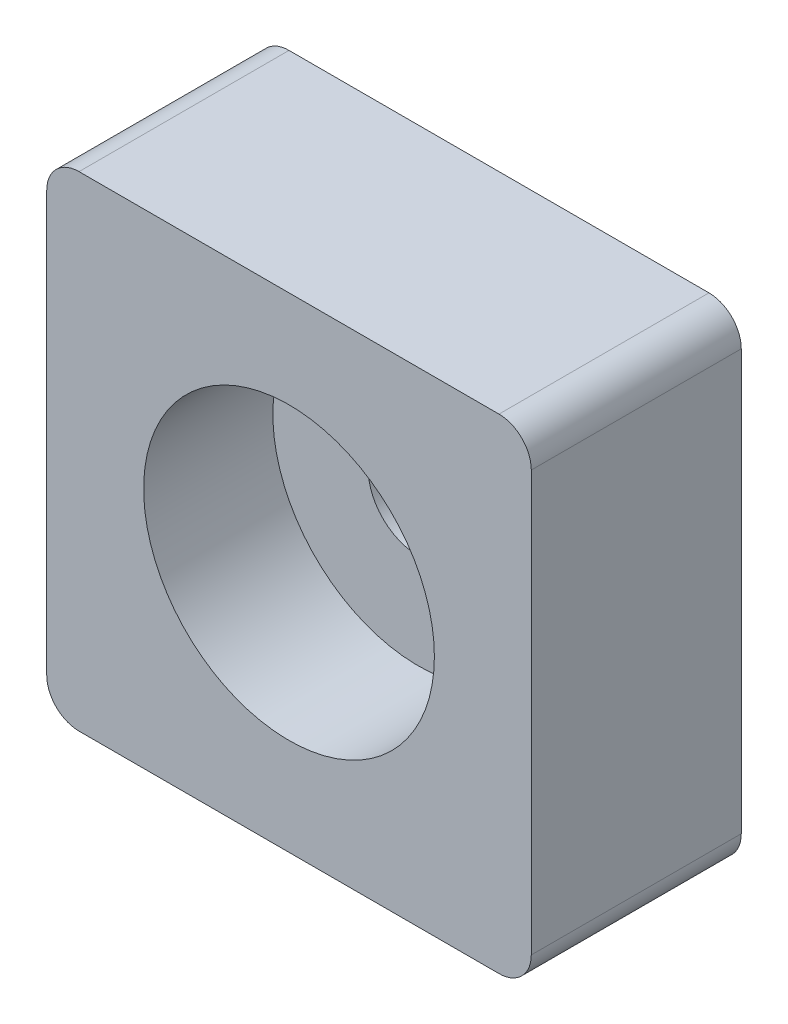
ISO-10303-21;
HEADER;
FILE_DESCRIPTION(('STEP AP214'),'2;1');
FILE_NAME('part.step','',(''),(''),'','','');
FILE_SCHEMA(('AUTOMOTIVE_DESIGN { 1 0 10303 214 1 1 1 1 }'));
ENDSEC;
DATA;
#1=APPLICATION_CONTEXT('core data for automotive mechanical design processes');
#2=APPLICATION_PROTOCOL_DEFINITION('international standard','automotive_design',2000,#1);
#3=PRODUCT_CONTEXT('',#1,'mechanical');
#4=PRODUCT('Part','Part','',(#3));
#5=PRODUCT_RELATED_PRODUCT_CATEGORY('part','',(#4));
#6=PRODUCT_DEFINITION_FORMATION('','',#4);
#7=PRODUCT_DEFINITION_CONTEXT('part definition',#1,'design');
#8=PRODUCT_DEFINITION('design','',#6,#7);
#9=PRODUCT_DEFINITION_SHAPE('','',#8);
#10=(LENGTH_UNIT() NAMED_UNIT(*) SI_UNIT(.MILLI.,.METRE.));
#11=(NAMED_UNIT(*) PLANE_ANGLE_UNIT() SI_UNIT($,.RADIAN.));
#12=(NAMED_UNIT(*) SI_UNIT($,.STERADIAN.) SOLID_ANGLE_UNIT());
#13=UNCERTAINTY_MEASURE_WITH_UNIT(LENGTH_MEASURE(1.E-05),#10,'distance_accuracy_value','');
#14=(GEOMETRIC_REPRESENTATION_CONTEXT(3) GLOBAL_UNCERTAINTY_ASSIGNED_CONTEXT((#13)) GLOBAL_UNIT_ASSIGNED_CONTEXT((#10,
#11,#12)) REPRESENTATION_CONTEXT('',''));
#15=CARTESIAN_POINT('',(0.,0.,0.));
#16=DIRECTION('',(0.,0.,1.));
#17=DIRECTION('',(1.,0.,0.));
#18=AXIS2_PLACEMENT_3D('',#15,#16,#17);
#19=CARTESIAN_POINT('',(0.,0.,13.));
#20=DIRECTION('',(0.,0.,-1.));
#21=DIRECTION('',(-1.,0.,0.));
#22=AXIS2_PLACEMENT_3D('',#19,#20,#21);
#23=CYLINDRICAL_SURFACE('',#22,3.1);
#24=CARTESIAN_POINT('',(0.,0.,0.));
#25=DIRECTION('',(0.,0.,1.));
#26=DIRECTION('',(1.,0.,0.));
#27=AXIS2_PLACEMENT_3D('',#24,#25,#26);
#28=CIRCLE('',#27,3.1);
#29=CARTESIAN_POINT('',(3.1,0.,0.));
#30=VERTEX_POINT('',#29);
#31=EDGE_CURVE('E140',#30,#30,#28,.T.);
#32=ORIENTED_EDGE('',*,*,#31,.F.);
#33=EDGE_LOOP('',(#32));
#34=FACE_BOUND('',#33,.T.);
#35=CARTESIAN_POINT('',(0.,0.,5.));
#36=DIRECTION('',(0.,0.,1.));
#37=DIRECTION('',(1.,0.,0.));
#38=AXIS2_PLACEMENT_3D('',#35,#36,#37);
#39=CIRCLE('',#38,3.1);
#40=CARTESIAN_POINT('',(3.1,0.,5.));
#41=VERTEX_POINT('',#40);
#42=EDGE_CURVE('E137',#41,#41,#39,.T.);
#43=ORIENTED_EDGE('',*,*,#42,.T.);
#44=EDGE_LOOP('',(#43));
#45=FACE_BOUND('',#44,.T.);
#46=ADVANCED_FACE('F37',(#34,#45),#23,.F.);
#47=CARTESIAN_POINT('',(0.,0.,13.));
#48=DIRECTION('',(0.,0.,-1.));
#49=DIRECTION('',(-1.,0.,0.));
#50=AXIS2_PLACEMENT_3D('',#47,#48,#49);
#51=PLANE('',#50);
#52=CARTESIAN_POINT('',(0.,0.,13.));
#53=DIRECTION('',(0.,0.,1.));
#54=DIRECTION('',(1.,0.,0.));
#55=AXIS2_PLACEMENT_3D('',#52,#53,#54);
#56=CIRCLE('',#55,9.);
#57=CARTESIAN_POINT('',(9.,0.,13.));
#58=VERTEX_POINT('',#57);
#59=EDGE_CURVE('E203',#58,#58,#56,.T.);
#60=ORIENTED_EDGE('',*,*,#59,.F.);
#61=EDGE_LOOP('',(#60));
#62=FACE_BOUND('',#61,.T.);
#63=DIRECTION('',(-1.,0.,0.));
#64=VECTOR('',#63,1.);
#65=CARTESIAN_POINT('',(-15.,15.,13.));
#66=LINE('',#65,#64);
#67=CARTESIAN_POINT('',(13.,15.,13.));
#68=VERTEX_POINT('',#67);
#69=CARTESIAN_POINT('',(-13.,15.,13.));
#70=VERTEX_POINT('',#69);
#71=EDGE_CURVE('E178',#68,#70,#66,.T.);
#72=ORIENTED_EDGE('',*,*,#71,.T.);
#73=CARTESIAN_POINT('',(-13.,13.,13.));
#74=DIRECTION('',(0.,0.,-1.));
#75=DIRECTION('',(-1.,0.,0.));
#76=AXIS2_PLACEMENT_3D('',#73,#74,#75);
#77=CIRCLE('',#76,2.);
#78=CARTESIAN_POINT('',(-15.,13.,13.));
#79=VERTEX_POINT('',#78);
#80=EDGE_CURVE('E156',#70,#79,#77,.F.);
#81=ORIENTED_EDGE('',*,*,#80,.T.);
#82=DIRECTION('',(0.,-1.,0.));
#83=VECTOR('',#82,1.);
#84=CARTESIAN_POINT('',(-15.,-15.,13.));
#85=LINE('',#84,#83);
#86=CARTESIAN_POINT('',(-15.,-13.,13.));
#87=VERTEX_POINT('',#86);
#88=EDGE_CURVE('E121',#79,#87,#85,.T.);
#89=ORIENTED_EDGE('',*,*,#88,.T.);
#90=CARTESIAN_POINT('',(-13.,-13.,13.));
#91=DIRECTION('',(0.,0.,-1.));
#92=DIRECTION('',(-1.,0.,0.));
#93=AXIS2_PLACEMENT_3D('',#90,#91,#92);
#94=CIRCLE('',#93,2.);
#95=CARTESIAN_POINT('',(-13.,-15.,13.));
#96=VERTEX_POINT('',#95);
#97=EDGE_CURVE('E57',#87,#96,#94,.F.);
#98=ORIENTED_EDGE('',*,*,#97,.T.);
#99=DIRECTION('',(1.,0.,0.));
#100=VECTOR('',#99,1.);
#101=CARTESIAN_POINT('',(-15.,-15.,13.));
#102=LINE('',#101,#100);
#103=CARTESIAN_POINT('',(13.,-15.,13.));
#104=VERTEX_POINT('',#103);
#105=EDGE_CURVE('E142',#96,#104,#102,.T.);
#106=ORIENTED_EDGE('',*,*,#105,.T.);
#107=CARTESIAN_POINT('',(13.,-13.,13.));
#108=DIRECTION('',(0.,0.,-1.));
#109=DIRECTION('',(-1.,0.,0.));
#110=AXIS2_PLACEMENT_3D('',#107,#108,#109);
#111=CIRCLE('',#110,2.);
#112=CARTESIAN_POINT('',(15.,-13.,13.));
#113=VERTEX_POINT('',#112);
#114=EDGE_CURVE('E152',#104,#113,#111,.F.);
#115=ORIENTED_EDGE('',*,*,#114,.T.);
#116=DIRECTION('',(0.,1.,0.));
#117=VECTOR('',#116,1.);
#118=CARTESIAN_POINT('',(15.,-15.,13.));
#119=LINE('',#118,#117);
#120=CARTESIAN_POINT('',(15.,13.,13.));
#121=VERTEX_POINT('',#120);
#122=EDGE_CURVE('E131',#113,#121,#119,.T.);
#123=ORIENTED_EDGE('',*,*,#122,.T.);
#124=CARTESIAN_POINT('',(13.,13.,13.));
#125=DIRECTION('',(0.,0.,-1.));
#126=DIRECTION('',(-1.,0.,0.));
#127=AXIS2_PLACEMENT_3D('',#124,#125,#126);
#128=CIRCLE('',#127,2.);
#129=EDGE_CURVE('E154',#121,#68,#128,.F.);
#130=ORIENTED_EDGE('',*,*,#129,.T.);
#131=EDGE_LOOP('',(#72,#81,#89,#98,#106,#115,#123,#130));
#132=FACE_BOUND('',#131,.T.);
#133=ADVANCED_FACE('F191',(#62,#132),#51,.F.);
#134=CARTESIAN_POINT('',(0.,0.,0.));
#135=DIRECTION('',(0.,0.,-1.));
#136=DIRECTION('',(-1.,0.,0.));
#137=AXIS2_PLACEMENT_3D('',#134,#135,#136);
#138=PLANE('',#137);
#139=DIRECTION('',(0.,-1.,0.));
#140=VECTOR('',#139,1.);
#141=CARTESIAN_POINT('',(-15.,-15.,0.));
#142=LINE('',#141,#140);
#143=CARTESIAN_POINT('',(-15.,13.,0.));
#144=VERTEX_POINT('',#143);
#145=CARTESIAN_POINT('',(-15.,-13.,0.));
#146=VERTEX_POINT('',#145);
#147=EDGE_CURVE('E119',#144,#146,#142,.T.);
#148=ORIENTED_EDGE('',*,*,#147,.F.);
#149=CARTESIAN_POINT('',(-13.,13.,0.));
#150=DIRECTION('',(0.,0.,-1.));
#151=DIRECTION('',(-1.,0.,0.));
#152=AXIS2_PLACEMENT_3D('',#149,#150,#151);
#153=CIRCLE('',#152,2.);
#154=CARTESIAN_POINT('',(-13.,15.,0.));
#155=VERTEX_POINT('',#154);
#156=EDGE_CURVE('E102',#144,#155,#153,.T.);
#157=ORIENTED_EDGE('',*,*,#156,.T.);
#158=DIRECTION('',(-1.,0.,0.));
#159=VECTOR('',#158,1.);
#160=CARTESIAN_POINT('',(-15.,15.,0.));
#161=LINE('',#160,#159);
#162=CARTESIAN_POINT('',(13.,15.,0.));
#163=VERTEX_POINT('',#162);
#164=EDGE_CURVE('E129',#163,#155,#161,.T.);
#165=ORIENTED_EDGE('',*,*,#164,.F.);
#166=CARTESIAN_POINT('',(13.,13.,0.));
#167=DIRECTION('',(0.,0.,-1.));
#168=DIRECTION('',(-1.,0.,0.));
#169=AXIS2_PLACEMENT_3D('',#166,#167,#168);
#170=CIRCLE('',#169,2.);
#171=CARTESIAN_POINT('',(15.,13.,0.));
#172=VERTEX_POINT('',#171);
#173=EDGE_CURVE('E113',#163,#172,#170,.T.);
#174=ORIENTED_EDGE('',*,*,#173,.T.);
#175=DIRECTION('',(0.,1.,0.));
#176=VECTOR('',#175,1.);
#177=CARTESIAN_POINT('',(15.,-15.,0.));
#178=LINE('',#177,#176);
#179=CARTESIAN_POINT('',(15.,-13.,0.));
#180=VERTEX_POINT('',#179);
#181=EDGE_CURVE('E133',#180,#172,#178,.T.);
#182=ORIENTED_EDGE('',*,*,#181,.F.);
#183=CARTESIAN_POINT('',(13.,-13.,0.));
#184=DIRECTION('',(0.,0.,-1.));
#185=DIRECTION('',(-1.,0.,0.));
#186=AXIS2_PLACEMENT_3D('',#183,#184,#185);
#187=CIRCLE('',#186,2.);
#188=CARTESIAN_POINT('',(13.,-15.,0.));
#189=VERTEX_POINT('',#188);
#190=EDGE_CURVE('E145',#180,#189,#187,.T.);
#191=ORIENTED_EDGE('',*,*,#190,.T.);
#192=DIRECTION('',(1.,0.,0.));
#193=VECTOR('',#192,1.);
#194=CARTESIAN_POINT('',(-15.,-15.,0.));
#195=LINE('',#194,#193);
#196=CARTESIAN_POINT('',(-13.,-15.,0.));
#197=VERTEX_POINT('',#196);
#198=EDGE_CURVE('E128',#197,#189,#195,.T.);
#199=ORIENTED_EDGE('',*,*,#198,.F.);
#200=CARTESIAN_POINT('',(-13.,-13.,0.));
#201=DIRECTION('',(0.,0.,-1.));
#202=DIRECTION('',(-1.,0.,0.));
#203=AXIS2_PLACEMENT_3D('',#200,#201,#202);
#204=CIRCLE('',#203,2.);
#205=EDGE_CURVE('E122',#197,#146,#204,.T.);
#206=ORIENTED_EDGE('',*,*,#205,.T.);
#207=EDGE_LOOP('',(#148,#157,#165,#174,#182,#191,#199,#206));
#208=FACE_BOUND('',#207,.T.);
#209=ORIENTED_EDGE('',*,*,#31,.T.);
#210=EDGE_LOOP('',(#209));
#211=FACE_BOUND('',#210,.T.);
#212=ADVANCED_FACE('F125',(#208,#211),#138,.T.);
#213=CARTESIAN_POINT('',(15.,-15.,13.));
#214=DIRECTION('',(-1.,0.,0.));
#215=DIRECTION('',(0.,0.,1.));
#216=AXIS2_PLACEMENT_3D('',#213,#214,#215);
#217=PLANE('',#216);
#218=ORIENTED_EDGE('',*,*,#181,.T.);
#219=DIRECTION('',(0.,0.,-1.));
#220=VECTOR('',#219,1.);
#221=CARTESIAN_POINT('',(15.,13.,13.));
#222=LINE('',#221,#220);
#223=EDGE_CURVE('E161',#172,#121,#222,.F.);
#224=ORIENTED_EDGE('',*,*,#223,.T.);
#225=ORIENTED_EDGE('',*,*,#122,.F.);
#226=DIRECTION('',(0.,0.,-1.));
#227=VECTOR('',#226,1.);
#228=CARTESIAN_POINT('',(15.,-13.,13.));
#229=LINE('',#228,#227);
#230=EDGE_CURVE('E158',#113,#180,#229,.T.);
#231=ORIENTED_EDGE('',*,*,#230,.T.);
#232=EDGE_LOOP('',(#218,#224,#225,#231));
#233=FACE_BOUND('',#232,.T.);
#234=ADVANCED_FACE('F174',(#233),#217,.F.);
#235=CARTESIAN_POINT('',(-15.,15.,13.));
#236=DIRECTION('',(0.,-1.,0.));
#237=DIRECTION('',(0.,0.,-1.));
#238=AXIS2_PLACEMENT_3D('',#235,#236,#237);
#239=PLANE('',#238);
#240=ORIENTED_EDGE('',*,*,#164,.T.);
#241=DIRECTION('',(0.,0.,-1.));
#242=VECTOR('',#241,1.);
#243=CARTESIAN_POINT('',(-13.,15.,13.));
#244=LINE('',#243,#242);
#245=EDGE_CURVE('E107',#155,#70,#244,.F.);
#246=ORIENTED_EDGE('',*,*,#245,.T.);
#247=ORIENTED_EDGE('',*,*,#71,.F.);
#248=DIRECTION('',(0.,0.,-1.));
#249=VECTOR('',#248,1.);
#250=CARTESIAN_POINT('',(13.,15.,13.));
#251=LINE('',#250,#249);
#252=EDGE_CURVE('E112',#68,#163,#251,.T.);
#253=ORIENTED_EDGE('',*,*,#252,.T.);
#254=EDGE_LOOP('',(#240,#246,#247,#253));
#255=FACE_BOUND('',#254,.T.);
#256=ADVANCED_FACE('F214',(#255),#239,.F.);
#257=CARTESIAN_POINT('',(-15.,-15.,13.));
#258=DIRECTION('',(1.,0.,0.));
#259=DIRECTION('',(0.,0.,-1.));
#260=AXIS2_PLACEMENT_3D('',#257,#258,#259);
#261=PLANE('',#260);
#262=ORIENTED_EDGE('',*,*,#88,.F.);
#263=DIRECTION('',(0.,0.,-1.));
#264=VECTOR('',#263,1.);
#265=CARTESIAN_POINT('',(-15.,13.,13.));
#266=LINE('',#265,#264);
#267=EDGE_CURVE('E106',#79,#144,#266,.T.);
#268=ORIENTED_EDGE('',*,*,#267,.T.);
#269=ORIENTED_EDGE('',*,*,#147,.T.);
#270=DIRECTION('',(0.,0.,-1.));
#271=VECTOR('',#270,1.);
#272=CARTESIAN_POINT('',(-15.,-13.,13.));
#273=LINE('',#272,#271);
#274=EDGE_CURVE('E123',#146,#87,#273,.F.);
#275=ORIENTED_EDGE('',*,*,#274,.T.);
#276=EDGE_LOOP('',(#262,#268,#269,#275));
#277=FACE_BOUND('',#276,.T.);
#278=ADVANCED_FACE('F118',(#277),#261,.F.);
#279=CARTESIAN_POINT('',(-15.,-15.,13.));
#280=DIRECTION('',(0.,1.,0.));
#281=DIRECTION('',(0.,0.,1.));
#282=AXIS2_PLACEMENT_3D('',#279,#280,#281);
#283=PLANE('',#282);
#284=ORIENTED_EDGE('',*,*,#198,.T.);
#285=DIRECTION('',(0.,0.,-1.));
#286=VECTOR('',#285,1.);
#287=CARTESIAN_POINT('',(13.,-15.,13.));
#288=LINE('',#287,#286);
#289=EDGE_CURVE('E11',#189,#104,#288,.F.);
#290=ORIENTED_EDGE('',*,*,#289,.T.);
#291=ORIENTED_EDGE('',*,*,#105,.F.);
#292=DIRECTION('',(0.,0.,-1.));
#293=VECTOR('',#292,1.);
#294=CARTESIAN_POINT('',(-13.,-15.,13.));
#295=LINE('',#294,#293);
#296=EDGE_CURVE('E45',#96,#197,#295,.T.);
#297=ORIENTED_EDGE('',*,*,#296,.T.);
#298=EDGE_LOOP('',(#284,#290,#291,#297));
#299=FACE_BOUND('',#298,.T.);
#300=ADVANCED_FACE('F164',(#299),#283,.F.);
#301=CARTESIAN_POINT('',(0.,0.,5.));
#302=DIRECTION('',(0.,0.,1.));
#303=DIRECTION('',(1.,0.,0.));
#304=AXIS2_PLACEMENT_3D('',#301,#302,#303);
#305=CYLINDRICAL_SURFACE('',#304,9.);
#306=CARTESIAN_POINT('',(0.,0.,5.));
#307=DIRECTION('',(0.,0.,1.));
#308=DIRECTION('',(1.,0.,0.));
#309=AXIS2_PLACEMENT_3D('',#306,#307,#308);
#310=CIRCLE('',#309,9.);
#311=CARTESIAN_POINT('',(9.,0.,5.));
#312=VERTEX_POINT('',#311);
#313=EDGE_CURVE('E141',#312,#312,#310,.T.);
#314=ORIENTED_EDGE('',*,*,#313,.F.);
#315=EDGE_LOOP('',(#314));
#316=FACE_BOUND('',#315,.T.);
#317=ORIENTED_EDGE('',*,*,#59,.T.);
#318=EDGE_LOOP('',(#317));
#319=FACE_BOUND('',#318,.T.);
#320=ADVANCED_FACE('F198',(#316,#319),#305,.F.);
#321=CARTESIAN_POINT('',(0.,0.,5.));
#322=DIRECTION('',(0.,0.,1.));
#323=DIRECTION('',(1.,0.,0.));
#324=AXIS2_PLACEMENT_3D('',#321,#322,#323);
#325=PLANE('',#324);
#326=ORIENTED_EDGE('',*,*,#42,.F.);
#327=EDGE_LOOP('',(#326));
#328=FACE_BOUND('',#327,.T.);
#329=ORIENTED_EDGE('',*,*,#313,.T.);
#330=EDGE_LOOP('',(#329));
#331=FACE_BOUND('',#330,.T.);
#332=ADVANCED_FACE('F195',(#328,#331),#325,.T.);
#333=CARTESIAN_POINT('',(-13.,13.,13.));
#334=DIRECTION('',(0.,0.,-1.));
#335=DIRECTION('',(-1.,0.,0.));
#336=AXIS2_PLACEMENT_3D('',#333,#334,#335);
#337=CYLINDRICAL_SURFACE('',#336,2.);
#338=ORIENTED_EDGE('',*,*,#80,.F.);
#339=ORIENTED_EDGE('',*,*,#245,.F.);
#340=ORIENTED_EDGE('',*,*,#156,.F.);
#341=ORIENTED_EDGE('',*,*,#267,.F.);
#342=EDGE_LOOP('',(#338,#339,#340,#341));
#343=FACE_BOUND('',#342,.T.);
#344=ADVANCED_FACE('F105',(#343),#337,.T.);
#345=CARTESIAN_POINT('',(13.,13.,13.));
#346=DIRECTION('',(0.,0.,-1.));
#347=DIRECTION('',(-1.,0.,0.));
#348=AXIS2_PLACEMENT_3D('',#345,#346,#347);
#349=CYLINDRICAL_SURFACE('',#348,2.);
#350=ORIENTED_EDGE('',*,*,#129,.F.);
#351=ORIENTED_EDGE('',*,*,#223,.F.);
#352=ORIENTED_EDGE('',*,*,#173,.F.);
#353=ORIENTED_EDGE('',*,*,#252,.F.);
#354=EDGE_LOOP('',(#350,#351,#352,#353));
#355=FACE_BOUND('',#354,.T.);
#356=ADVANCED_FACE('F216',(#355),#349,.T.);
#357=CARTESIAN_POINT('',(13.,-13.,13.));
#358=DIRECTION('',(0.,0.,-1.));
#359=DIRECTION('',(-1.,0.,0.));
#360=AXIS2_PLACEMENT_3D('',#357,#358,#359);
#361=CYLINDRICAL_SURFACE('',#360,2.);
#362=ORIENTED_EDGE('',*,*,#114,.F.);
#363=ORIENTED_EDGE('',*,*,#289,.F.);
#364=ORIENTED_EDGE('',*,*,#190,.F.);
#365=ORIENTED_EDGE('',*,*,#230,.F.);
#366=EDGE_LOOP('',(#362,#363,#364,#365));
#367=FACE_BOUND('',#366,.T.);
#368=ADVANCED_FACE('F171',(#367),#361,.T.);
#369=CARTESIAN_POINT('',(-13.,-13.,13.));
#370=DIRECTION('',(0.,0.,-1.));
#371=DIRECTION('',(-1.,0.,0.));
#372=AXIS2_PLACEMENT_3D('',#369,#370,#371);
#373=CYLINDRICAL_SURFACE('',#372,2.);
#374=ORIENTED_EDGE('',*,*,#97,.F.);
#375=ORIENTED_EDGE('',*,*,#274,.F.);
#376=ORIENTED_EDGE('',*,*,#205,.F.);
#377=ORIENTED_EDGE('',*,*,#296,.F.);
#378=EDGE_LOOP('',(#374,#375,#376,#377));
#379=FACE_BOUND('',#378,.T.);
#380=ADVANCED_FACE('F39',(#379),#373,.T.);
#381=CLOSED_SHELL('',(#46,#133,#212,#234,#256,#278,#300,#320,#332,#344,#356,#368,#380));
#382=MANIFOLD_SOLID_BREP('B2',#381);
#383=ADVANCED_BREP_SHAPE_REPRESENTATION('',(#18,#382),#14);
#384=SHAPE_DEFINITION_REPRESENTATION(#9,#383);
ENDSEC;
END-ISO-10303-21;
